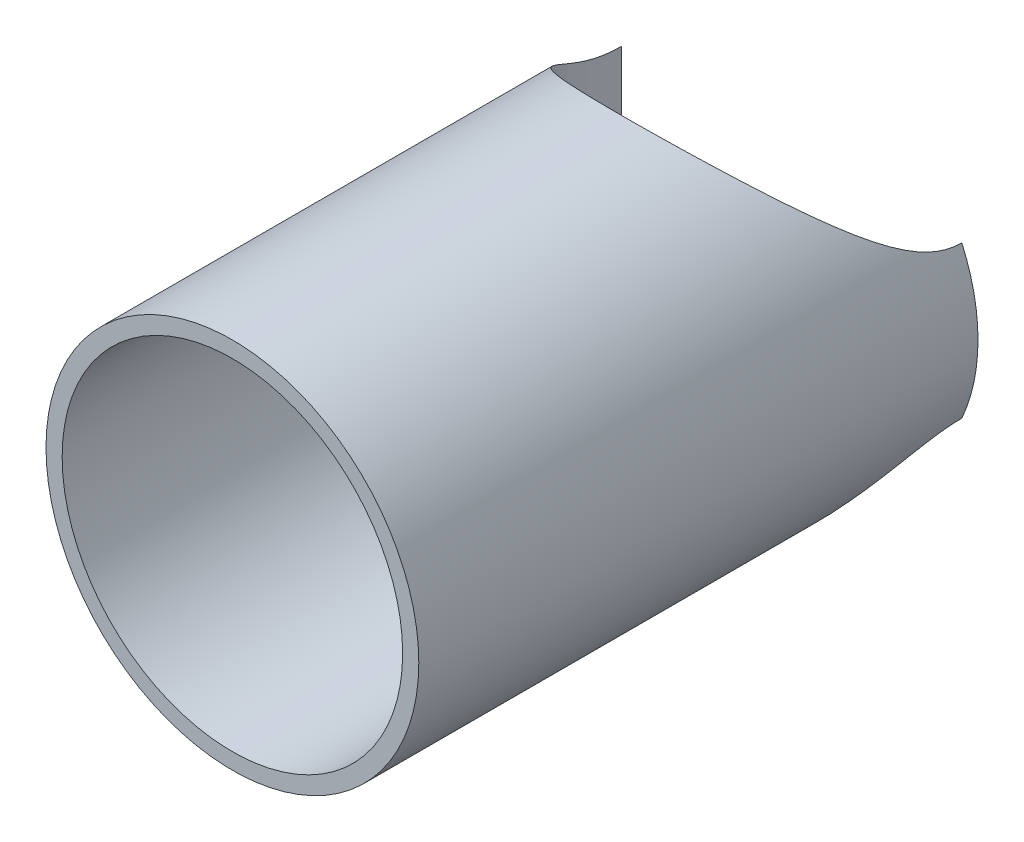
ISO-10303-21;
HEADER;
FILE_DESCRIPTION(('STEP AP214'),'2;1');
FILE_NAME('part.step','',(''),(''),'','','');
FILE_SCHEMA(('AUTOMOTIVE_DESIGN { 1 0 10303 214 1 1 1 1 }'));
ENDSEC;
DATA;
#1=APPLICATION_CONTEXT('core data for automotive mechanical design processes');
#2=APPLICATION_PROTOCOL_DEFINITION('international standard','automotive_design',2000,#1);
#3=PRODUCT_CONTEXT('',#1,'mechanical');
#4=PRODUCT('Part','Part','',(#3));
#5=PRODUCT_RELATED_PRODUCT_CATEGORY('part','',(#4));
#6=PRODUCT_DEFINITION_FORMATION('','',#4);
#7=PRODUCT_DEFINITION_CONTEXT('part definition',#1,'design');
#8=PRODUCT_DEFINITION('design','',#6,#7);
#9=PRODUCT_DEFINITION_SHAPE('','',#8);
#10=(LENGTH_UNIT() NAMED_UNIT(*) SI_UNIT(.MILLI.,.METRE.));
#11=(NAMED_UNIT(*) PLANE_ANGLE_UNIT() SI_UNIT($,.RADIAN.));
#12=(NAMED_UNIT(*) SI_UNIT($,.STERADIAN.) SOLID_ANGLE_UNIT());
#13=UNCERTAINTY_MEASURE_WITH_UNIT(LENGTH_MEASURE(1.E-05),#10,'distance_accuracy_value','');
#14=(GEOMETRIC_REPRESENTATION_CONTEXT(3) GLOBAL_UNCERTAINTY_ASSIGNED_CONTEXT((#13)) GLOBAL_UNIT_ASSIGNED_CONTEXT((#10,
#11,#12)) REPRESENTATION_CONTEXT('',''));
#15=CARTESIAN_POINT('',(0.,0.,0.));
#16=DIRECTION('',(0.,0.,1.));
#17=DIRECTION('',(1.,0.,0.));
#18=AXIS2_PLACEMENT_3D('',#15,#16,#17);
#19=CARTESIAN_POINT('',(0.,0.,0.));
#20=DIRECTION('',(0.,0.,1.));
#21=DIRECTION('',(1.,0.,0.));
#22=AXIS2_PLACEMENT_3D('',#19,#20,#21);
#23=CYLINDRICAL_SURFACE('',#22,17.399);
#24=CARTESIAN_POINT('',(0.,0.,57.15));
#25=DIRECTION('',(0.,0.,1.));
#26=DIRECTION('',(1.,0.,0.));
#27=AXIS2_PLACEMENT_3D('',#24,#25,#26);
#28=CIRCLE('',#27,17.399);
#29=CARTESIAN_POINT('',(17.399,0.,57.15));
#30=VERTEX_POINT('',#29);
#31=EDGE_CURVE('E64',#30,#30,#28,.T.);
#32=ORIENTED_EDGE('',*,*,#31,.T.);
#33=EDGE_LOOP('',(#32));
#34=FACE_BOUND('',#33,.T.);
#35=CARTESIAN_POINT('',(0.,0.,0.));
#36=DIRECTION('',(0.,0.707106781186547,0.707106781186547));
#37=DIRECTION('',(0.,-0.707106781186547,0.707106781186547));
#38=AXIS2_PLACEMENT_3D('',#35,#36,#37);
#39=ELLIPSE('',#38,24.6059017717295,17.399);
#40=CARTESIAN_POINT('',(17.399,0.,0.));
#41=VERTEX_POINT('',#40);
#42=CARTESIAN_POINT('',(-17.399,0.,0.));
#43=VERTEX_POINT('',#42);
#44=EDGE_CURVE('E67',#41,#43,#39,.F.);
#45=ORIENTED_EDGE('',*,*,#44,.T.);
#46=CARTESIAN_POINT('',(-17.399,0.,0.));
#47=CARTESIAN_POINT('',(-17.3990011308637,0.331328994913658,0.331288499369272));
#48=CARTESIAN_POINT('',(-17.3895359806133,0.662777773993524,0.662452537391861));
#49=CARTESIAN_POINT('',(-17.3541828902262,1.28061881246956,1.27984220901783));
#50=CARTESIAN_POINT('',(-17.3306707170862,1.56708522254114,1.56613126731348));
#51=CARTESIAN_POINT('',(-17.2741593932983,2.09467960281504,2.09380128423432));
#52=CARTESIAN_POINT('',(-17.2431973119173,2.33594824844743,2.33526043823023));
#53=CARTESIAN_POINT('',(-17.1776790099059,2.77346193365283,2.77318291899473));
#54=CARTESIAN_POINT('',(-17.1448260231368,2.96984141024758,2.96976916303656));
#55=CARTESIAN_POINT('',(-17.053195396441,3.46498957987095,3.46509972389225));
#56=CARTESIAN_POINT('',(-16.98985851291,3.76343285860517,3.76334049026127));
#57=CARTESIAN_POINT('',(-16.8511806994521,4.34120611378342,4.34086899698307));
#58=CARTESIAN_POINT('',(-16.7767389829828,4.62064871339775,4.62026081720835));
#59=CARTESIAN_POINT('',(-16.618357658026,5.16038592403,5.16002415026488));
#60=CARTESIAN_POINT('',(-16.5352733410015,5.42080962241243,5.42051715790507));
#61=CARTESIAN_POINT('',(-16.3619682824427,5.9225854699662,5.92246621840775));
#62=CARTESIAN_POINT('',(-16.2725596410971,6.16407928160144,6.16406139907093));
#63=CARTESIAN_POINT('',(-16.0648641936773,6.68870400423923,6.68872514664784));
#64=CARTESIAN_POINT('',(-15.9442842191765,6.97140000285117,6.97132558864669));
#65=CARTESIAN_POINT('',(-15.692090264551,7.52138357655295,7.52117234296158));
#66=CARTESIAN_POINT('',(-15.5611400425067,7.7888244237628,7.78856984279287));
#67=CARTESIAN_POINT('',(-15.2898825899193,8.30823658158246,8.30799045094507));
#68=CARTESIAN_POINT('',(-15.1502208515848,8.56037821331848,8.56017986480889));
#69=CARTESIAN_POINT('',(-14.8631475667476,9.04924098266211,9.04916207079481));
#70=CARTESIAN_POINT('',(-14.716363574788,9.28614688008941,9.28613845727461));
#71=CARTESIAN_POINT('',(-14.3951906833458,9.77740171343267,9.77741091638758));
#72=CARTESIAN_POINT('',(-14.2195041976432,10.0313338750929,10.0312781848761));
#73=CARTESIAN_POINT('',(-13.8583245878214,10.524357664459,10.5242054716175));
#74=CARTESIAN_POINT('',(-13.6733966582859,10.7636567269108,10.7634718304358));
#75=CARTESIAN_POINT('',(-13.2950314709039,11.2273598541476,11.2271796122021));
#76=CARTESIAN_POINT('',(-13.1021449124595,11.4519894946947,11.4518441165275));
#77=CARTESIAN_POINT('',(-12.7091177143155,11.8863833716026,11.8863260772742));
#78=CARTESIAN_POINT('',(-12.5095124093792,12.0963898718007,12.0963850678313));
#79=CARTESIAN_POINT('',(-12.0888476825434,12.5170535611354,12.5170585405004));
#80=CARTESIAN_POINT('',(-11.867271036784,12.7274545640097,12.7274132906681));
#81=CARTESIAN_POINT('',(-11.4161369932612,13.1334001596869,13.1332890696922));
#82=CARTESIAN_POINT('',(-11.1870452916996,13.3292035388693,13.3290682211509));
#83=CARTESIAN_POINT('',(-10.7219396261346,13.7059083660326,13.7057759704559));
#84=CARTESIAN_POINT('',(-10.4863707163118,13.8870849012415,13.8869780619076));
#85=CARTESIAN_POINT('',(-10.0093409437893,14.2345561896179,14.2345143840518));
#86=CARTESIAN_POINT('',(-9.76830223262916,14.4011404127409,14.4011376187175));
#87=CARTESIAN_POINT('',(-9.27469282491392,14.7238513521684,14.7238541327518));
#88=CARTESIAN_POINT('',(-9.02218317762893,14.8800245173527,14.8799942085943));
#89=CARTESIAN_POINT('',(-8.51143320550011,15.17780577695,15.1777255632559));
#90=CARTESIAN_POINT('',(-8.25351231100356,15.3196868999698,15.3195894701364));
#91=CARTESIAN_POINT('',(-7.86055793692457,15.522822723787,15.5227259132659));
#92=CARTESIAN_POINT('',(-7.72987393547371,15.5883224924115,15.5882301268393));
#93=CARTESIAN_POINT('',(-7.46744079934224,15.7157097134347,15.7156329083403));
#94=CARTESIAN_POINT('',(-7.33572578439618,15.7776322605029,15.7775664862578));
#95=CARTESIAN_POINT('',(-7.0713408526649,15.89786675948,15.8978253102093));
#96=CARTESIAN_POINT('',(-6.93870294731716,15.9562139212813,15.9561857364243));
#97=CARTESIAN_POINT('',(-6.67257484172981,16.0693059665347,16.0692983003262));
#98=CARTESIAN_POINT('',(-6.5391145696896,16.124086000282,16.1240856593634));
#99=CARTESIAN_POINT('',(-6.27314212663758,16.2293820508048,16.2293823833748));
#100=CARTESIAN_POINT('',(-6.14068677200883,16.2799696359967,16.2799636546496));
#101=CARTESIAN_POINT('',(-5.8748684496391,16.3777589819801,16.3777371159858));
#102=CARTESIAN_POINT('',(-5.74152553126073,16.4249879659121,16.4249565601746));
#103=CARTESIAN_POINT('',(-5.47402115877983,16.5160550971116,16.5160062636609));
#104=CARTESIAN_POINT('',(-5.33987788890363,16.5599199494832,16.5598632139616));
#105=CARTESIAN_POINT('',(-5.0708615482511,16.6442561413558,16.6441886913204));
#106=CARTESIAN_POINT('',(-4.93600480608221,16.6847535344294,16.6846832285512));
#107=CARTESIAN_POINT('',(-4.66564969995905,16.7623545036231,16.762284561608));
#108=CARTESIAN_POINT('',(-4.53016583341798,16.7994833464645,16.7994165741733));
#109=CARTESIAN_POINT('',(-4.25864402464156,16.8703492415508,16.8702936771996));
#110=CARTESIAN_POINT('',(-4.1226187875179,16.9041106384636,16.9040630739031));
#111=CARTESIAN_POINT('',(-3.85010126264908,16.9682459387044,16.9682159832133));
#112=CARTESIAN_POINT('',(-3.7136199403314,16.9986431310521,16.9986227724491));
#113=CARTESIAN_POINT('',(-3.44027598403682,17.0560566629996,17.0560512035975));
#114=CARTESIAN_POINT('',(-3.30342264906392,17.0830951044979,17.0830949768953));
#115=CARTESIAN_POINT('',(-3.03546364409865,17.1326815825355,17.132681703699));
#116=CARTESIAN_POINT('',(-2.90441642762355,17.1553873643714,17.1553829144864));
#117=CARTESIAN_POINT('',(-2.64192370290757,17.1977626436417,17.1977466393632));
#118=CARTESIAN_POINT('',(-2.51048219796085,17.2174445285761,17.2174215511955));
#119=CARTESIAN_POINT('',(-2.24727207444598,17.2537692378582,17.2537335254227));
#120=CARTESIAN_POINT('',(-2.11550651579715,17.2704231484942,17.2703816696755));
#121=CARTESIAN_POINT('',(-1.85171901959868,17.3006908882117,17.3006415630633));
#122=CARTESIAN_POINT('',(-1.71969931056298,17.3143144308917,17.3142630138654));
#123=CARTESIAN_POINT('',(-1.45547409463277,17.3385220761164,17.3384708920411));
#124=CARTESIAN_POINT('',(-1.323270104293,17.3491144575098,17.3490655860987));
#125=CARTESIAN_POINT('',(-1.05874661674972,17.3672620877226,17.36722140925));
#126=CARTESIAN_POINT('',(-0.926428051590948,17.3748241285407,17.3747893222893));
#127=CARTESIAN_POINT('',(-0.661745401360201,17.3869150272733,17.3868930938386));
#128=CARTESIAN_POINT('',(-0.529381797623768,17.3914491490759,17.3914342142522));
#129=CARTESIAN_POINT('',(-0.264678682179303,17.3974897824417,17.3974858865217));
#130=CARTESIAN_POINT('',(-0.13233933998178,17.3989999999915,17.3990001479815));
#131=CARTESIAN_POINT('',(0.132343102844987,17.3990000000085,17.3989998520142));
#132=CARTESIAN_POINT('',(0.264686203474104,17.3974896965932,17.3974852084662));
#133=CARTESIAN_POINT('',(0.529395756251864,17.3914487446318,17.3914329206721));
#134=CARTESIAN_POINT('',(0.661762040001853,17.3869144144388,17.3868915915467));
#135=CARTESIAN_POINT('',(0.92644896772938,17.3748230255675,17.3747874520819));
#136=CARTESIAN_POINT('',(1.0587691326032,17.3672607273787,17.3672194044208));
#137=CARTESIAN_POINT('',(1.32329473756529,17.3491125827395,17.3490633877189));
#138=CARTESIAN_POINT('',(1.4554992489517,17.3385199686424,17.3384686592246));
#139=CARTESIAN_POINT('',(1.71972442920772,17.3143119319016,17.3142607827641));
#140=CARTESIAN_POINT('',(1.85174358595603,17.3006882546736,17.300639392332));
#141=CARTESIAN_POINT('',(2.11552890590344,17.2704203934741,17.270379685527));
#142=CARTESIAN_POINT('',(2.24729284607558,17.2537665200233,17.2537316913085));
#143=CARTESIAN_POINT('',(2.51049867631982,17.2174421050912,17.2174201090593));
#144=CARTESIAN_POINT('',(2.64193751299076,17.1977605012373,17.1977454625961));
#145=CARTESIAN_POINT('',(2.90442384157753,17.1553860801165,17.1553822628499));
#146=CARTESIAN_POINT('',(3.03546733761075,17.1326808990283,17.1326813342488));
#147=CARTESIAN_POINT('',(3.30342657291425,17.0830943783941,17.0830939200179));
#148=CARTESIAN_POINT('',(3.44028379405071,17.0560551202761,17.0560490037316));
#149=CARTESIAN_POINT('',(3.71363437804045,16.9986400001387,16.9986186527062));
#150=CARTESIAN_POINT('',(3.85011845296442,16.9682420615591,16.9682111142236));
#151=CARTESIAN_POINT('',(4.12264033144995,16.904105398461,16.9040569697761));
#152=CARTESIAN_POINT('',(4.25866718163659,16.870343410098,16.8702871133423));
#153=CARTESIAN_POINT('',(4.53019108564152,16.7994765416222,16.7994093825609));
#154=CARTESIAN_POINT('',(4.66567544748057,16.76234734177,16.7622772275004));
#155=CARTESIAN_POINT('',(4.9360304323311,16.6847459483422,16.6846758961775));
#156=CARTESIAN_POINT('',(5.0708865720189,16.6442485126905,16.6441815277317));
#157=CARTESIAN_POINT('',(5.33990061783175,16.55991260583,16.5598566711235));
#158=CARTESIAN_POINT('',(5.47404221030653,16.5160481053818,16.5160001963081));
#159=CARTESIAN_POINT('',(5.74154217437029,16.4249821235549,16.4249517522341));
#160=CARTESIAN_POINT('',(5.87488237757024,16.3777539610281,16.377733114662));
#161=CARTESIAN_POINT('',(6.14069421589947,16.2799667936959,16.2799614823963));
#162=CARTESIAN_POINT('',(6.27314581793012,16.2293805894571,16.2293812542933));
#163=CARTESIAN_POINT('',(6.53911843369672,16.1240844705558,16.1240837889914));
#164=CARTESIAN_POINT('',(6.6725825007365,16.0693028234905,16.0692944809927));
#165=CARTESIAN_POINT('',(6.93871704145251,15.9562078188688,15.956178611685));
#166=CARTESIAN_POINT('',(7.07135760783225,15.8978593336773,15.8978168557831));
#167=CARTESIAN_POINT('',(7.33574670377706,15.7776225505781,15.7775558713312));
#168=CARTESIAN_POINT('',(7.46746324313444,15.7156990653493,15.7156214868573));
#169=CARTESIAN_POINT('',(7.72989830986156,15.5883104113434,15.5882176122188));
#170=CARTESIAN_POINT('',(7.86058273950878,15.5228101701612,15.5227131352272));
#171=CARTESIAN_POINT('',(8.25353521535424,15.3196745134129,15.3195775255319));
#172=CARTESIAN_POINT('',(8.51145389332373,15.177794126177,15.1777148432391));
#173=CARTESIAN_POINT('',(9.02219526517278,14.8800170481196,14.8799876943916));
#174=CARTESIAN_POINT('',(9.27469871505861,14.7238475016823,14.7238507467716));
#175=CARTESIAN_POINT('',(9.76830834571355,14.4011364157789,14.4011331548459));
#176=CARTESIAN_POINT('',(10.0093528614838,14.2345479589407,14.2345052423058));
#177=CARTESIAN_POINT('',(10.4863899241457,13.8870704451552,13.8869626730327));
#178=CARTESIAN_POINT('',(10.7219605410667,13.7058920566566,13.7057591792237));
#179=CARTESIAN_POINT('',(11.1870656131564,13.3291864289314,13.3290515004162));
#180=CARTESIAN_POINT('',(11.4161552377849,13.1333842417648,13.1332739587925));
#181=CARTESIAN_POINT('',(11.8672815432061,12.7274445947568,12.7274041499341));
#182=CARTESIAN_POINT('',(12.088852755031,12.5170484889207,12.517053873492));
#183=CARTESIAN_POINT('',(12.5095175578729,12.0963847230684,12.0963795279133));
#184=CARTESIAN_POINT('',(12.7091276713605,11.8863729021756,11.8863148376935));
#185=CARTESIAN_POINT('',(13.1021607290177,11.4519714571547,11.4518252711373));
#186=CARTESIAN_POINT('',(13.2950485751887,11.2273396628897,11.2271589823143));
#187=CARTESIAN_POINT('',(13.6734130173025,10.7636358783721,10.763451251504));
#188=CARTESIAN_POINT('',(13.858339153512,10.524338411798,10.5241868247927));
#189=CARTESIAN_POINT('',(14.2195124215554,10.031321996054,10.0312669453136));
#190=CARTESIAN_POINT('',(14.3951946051437,9.7773957150844,9.77740523066256));
#191=CARTESIAN_POINT('',(14.7163674472392,9.28614095665167,9.28613224729147));
#192=CARTESIAN_POINT('',(14.8631549792588,9.04922902525791,9.04914954618527));
#193=CARTESIAN_POINT('',(15.1502323847489,8.56035787657117,8.56015891678717));
#194=CARTESIAN_POINT('',(15.2898949291603,8.30821395404564,8.3079674730765));
#195=CARTESIAN_POINT('',(15.5611515555253,7.78880133314123,7.78854689744975));
#196=CARTESIAN_POINT('',(15.6921003797321,7.52136237689545,7.52115152000875));
#197=CARTESIAN_POINT('',(15.944289741381,6.97138706353182,6.97131306349413));
#198=CARTESIAN_POINT('',(16.0648667682493,6.68869750139016,6.68871884448677));
#199=CARTESIAN_POINT('',(16.2725620824778,6.16407311454511,6.16405506139386));
#200=CARTESIAN_POINT('',(16.3619728725739,5.92257307722494,5.92245348547243));
#201=CARTESIAN_POINT('',(16.535280221155,5.42078874277266,5.42049589512133));
#202=CARTESIAN_POINT('',(16.618364872423,5.16036280687721,5.16000079710574));
#203=CARTESIAN_POINT('',(16.7767453827511,4.62062534005807,4.62023748154183));
#204=CARTESIAN_POINT('',(16.8511861632785,4.34118475559803,4.34084779902526));
#205=CARTESIAN_POINT('',(16.9898612578486,3.76341993156685,3.7633277559053));
#206=CARTESIAN_POINT('',(17.053196594646,3.464983105639,3.46509333680204));
#207=CARTESIAN_POINT('',(17.1448268330524,2.96983703330779,2.96976472575839));
#208=CARTESIAN_POINT('',(17.1776804769336,2.77345316738225,2.7731740281345));
#209=CARTESIAN_POINT('',(17.2431993186325,2.33593358655074,2.33524560548374));
#210=CARTESIAN_POINT('',(17.2741613748475,2.09466343246891,2.09378498081143));
#211=CARTESIAN_POINT('',(17.3306721606797,1.567068988297,1.56611497024853));
#212=CARTESIAN_POINT('',(17.3541839563502,1.28060403473809,1.27982739369487));
#213=CARTESIAN_POINT('',(17.3895362343148,0.66276888754068,0.662443645442081));
#214=CARTESIAN_POINT('',(17.3990011304629,0.331324551349306,0.331284053321532));
#215=CARTESIAN_POINT('',(17.399,0.,0.));
#216=B_SPLINE_CURVE_WITH_KNOTS('',3,(#46,#47,#48,#49,#50,#51,#52,#53,#54,#55,#56,#57,#58,#59,
#60,#61,#62,#63,#64,#65,#66,#67,#68,#69,#70,#71,#72,#73,#74,#75,#76,#77,#78,#79,#80,#81,#82,#83,
#84,#85,#86,#87,#88,#89,#90,#91,#92,#93,#94,#95,#96,#97,#98,#99,#100,#101,#102,#103,#104,#105,
#106,#107,#108,#109,#110,#111,#112,#113,#114,#115,#116,#117,#118,#119,#120,#121,#122,#123,#124,
#125,#126,#127,#128,#129,#130,#131,#132,#133,#134,#135,#136,#137,#138,#139,#140,#141,#142,#143,
#144,#145,#146,#147,#148,#149,#150,#151,#152,#153,#154,#155,#156,#157,#158,#159,#160,#161,#162,
#163,#164,#165,#166,#167,#168,#169,#170,#171,#172,#173,#174,#175,#176,#177,#178,#179,#180,#181,
#182,#183,#184,#185,#186,#187,#188,#189,#190,#191,#192,#193,#194,#195,#196,#197,#198,#199,#200,
#201,#202,#203,#204,#205,#206,#207,#208,#209,#210,#211,#212,#213,#214,#215),.UNSPECIFIED.,.F.,
.F.,(4,2,2,2,2,2,2,2,2,2,2,2,2,2,2,2,2,2,2,2,2,2,2,2,2,2,2,2,2,2,2,2,2,2,2,2,2,2,2,2,2,2,2,2,2,
2,2,2,2,2,2,2,2,2,2,2,2,2,2,2,2,2,2,2,2,2,2,2,2,2,2,2,2,2,2,2,2,2,2,2,2,2,2,2,4),(0.,
1.40551630396895,2.62231117885233,3.65037899448081,4.48971758438184,5.76932583809445,
6.9753849332022,8.10794438794428,9.16706431128378,10.4192554462773,11.6195891287589,
12.7682494574323,13.8654466039762,15.0642686263511,16.2207668838282,17.3353827550133,
18.4086093128293,19.521019988392,20.5986721998633,21.6423941807822,22.6530975875911,
23.6589392392227,24.6386430781611,25.1191397415278,25.5935874776259,26.0621612660575,
26.5250427479471,26.9765889886385,27.423915460162,27.867213682969,28.3066804441005,
28.7425177205185,29.1749325751135,29.6041370240872,30.0303478746664,30.4350509025217,
30.8380491089705,31.239540728672,31.6397262351866,32.0388080704063,32.4369903595961,
32.8344786138765,33.23147942219,33.6284915186038,34.0259878478789,34.42417498677,
34.8232584392862,35.2234423286034,35.6249290994545,36.0279192330441,36.4326109763195,
36.8588341719642,37.2880474518629,37.720467610057,38.1563066551372,38.5957716476569,
39.0390645671939,39.486382208024,39.9379161021075,40.4008112215822,40.8693947623903,
41.3438483542563,41.8243469702461,42.8040430011724,43.8098612581141,44.8205903103499,
45.8643208478344,46.9419645023942,48.0543495253715,49.1276035107911,50.2422285290847,
51.3987176391151,52.5975122283296,53.6947376105801,54.8434073531731,56.043731621553,
57.2958945179331,58.3550419584849,59.487610586171,60.6936605083512,61.9732412444898,
62.8125986887249,63.8406727889923,65.0574613794757,66.4629588311663),.UNSPECIFIED.);
#217=EDGE_CURVE('E56',#43,#41,#216,.T.);
#218=ORIENTED_EDGE('',*,*,#217,.T.);
#219=EDGE_LOOP('',(#45,#218));
#220=FACE_BOUND('',#219,.T.);
#221=ADVANCED_FACE('F17',(#34,#220),#23,.F.);
#222=CARTESIAN_POINT('',(0.,0.,57.15));
#223=DIRECTION('',(0.,0.,-1.));
#224=DIRECTION('',(-1.,0.,0.));
#225=AXIS2_PLACEMENT_3D('',#222,#223,#224);
#226=PLANE('',#225);
#227=ORIENTED_EDGE('',*,*,#31,.F.);
#228=EDGE_LOOP('',(#227));
#229=FACE_BOUND('',#228,.T.);
#230=CARTESIAN_POINT('',(0.,0.,57.15));
#231=DIRECTION('',(0.,0.,1.));
#232=DIRECTION('',(1.,0.,0.));
#233=AXIS2_PLACEMENT_3D('',#230,#231,#232);
#234=CIRCLE('',#233,19.05);
#235=CARTESIAN_POINT('',(19.05,0.,57.15));
#236=VERTEX_POINT('',#235);
#237=EDGE_CURVE('E87',#236,#236,#234,.F.);
#238=ORIENTED_EDGE('',*,*,#237,.F.);
#239=EDGE_LOOP('',(#238));
#240=FACE_BOUND('',#239,.T.);
#241=ADVANCED_FACE('F122',(#229,#240),#226,.F.);
#242=CARTESIAN_POINT('',(0.,0.,0.));
#243=DIRECTION('',(0.,1.,0.));
#244=DIRECTION('',(0.,0.,1.));
#245=AXIS2_PLACEMENT_3D('',#242,#243,#244);
#246=CYLINDRICAL_SURFACE('',#245,17.399);
#247=ORIENTED_EDGE('',*,*,#217,.F.);
#248=DIRECTION('',(0.,1.,0.));
#249=VECTOR('',#248,1.);
#250=CARTESIAN_POINT('',(-17.399,0.,0.));
#251=LINE('',#250,#249);
#252=CARTESIAN_POINT('',(-17.399,7.75740285147033,0.));
#253=VERTEX_POINT('',#252);
#254=EDGE_CURVE('E61',#253,#43,#251,.F.);
#255=ORIENTED_EDGE('',*,*,#254,.F.);
#256=CARTESIAN_POINT('',(17.399,7.75740285147032,0.));
#257=CARTESIAN_POINT('',(17.3990027926557,7.75738928067626,0.126619411653411));
#258=CARTESIAN_POINT('',(17.3976172953479,7.76050481767002,0.25321342214225));
#259=CARTESIAN_POINT('',(17.3920993093259,7.7728663106787,0.506011561056936));
#260=CARTESIAN_POINT('',(17.3879674951789,7.78211076127069,0.632215777580589));
#261=CARTESIAN_POINT('',(17.3715310393773,7.81876986710136,1.00902330778525));
#262=CARTESIAN_POINT('',(17.3551849725285,7.85511193712096,1.25863541656879));
#263=CARTESIAN_POINT('',(17.3126787054344,7.94834436267528,1.74803233786395));
#264=CARTESIAN_POINT('',(17.2867118539878,8.00482912325347,1.98791378893045));
#265=CARTESIAN_POINT('',(17.2256220476168,8.13545614886296,2.46176178605719));
#266=CARTESIAN_POINT('',(17.1904915826852,8.20961289257842,2.69572330712606));
#267=CARTESIAN_POINT('',(17.0914704002142,8.41444164911149,3.27608545997221));
#268=CARTESIAN_POINT('',(17.0220928683165,8.55453145327276,3.6182148201961));
#269=CARTESIAN_POINT('',(16.8659507450822,8.85840913920196,4.2875618159471));
#270=CARTESIAN_POINT('',(16.7791763237468,9.02221040436538,4.6147708919803));
#271=CARTESIAN_POINT('',(16.5885907607409,9.36806215757178,5.25908025866418));
#272=CARTESIAN_POINT('',(16.4846028375362,9.55029344833314,5.57602990071133));
#273=CARTESIAN_POINT('',(16.2611162606568,9.92604811707565,6.19761374754541));
#274=CARTESIAN_POINT('',(16.1416117153161,10.1195757688457,6.50224321644266));
#275=CARTESIAN_POINT('',(15.9012328343761,10.4927199440383,7.0682446326165));
#276=CARTESIAN_POINT('',(15.7818795075659,10.6716028930283,7.33075234639334));
#277=CARTESIAN_POINT('',(15.531375280231,11.0330066315397,7.84755054304734));
#278=CARTESIAN_POINT('',(15.4002228366692,11.2155278944272,8.10183994524194));
#279=CARTESIAN_POINT('',(15.1261173325553,11.5825543909568,8.60275103720113));
#280=CARTESIAN_POINT('',(14.9831580377589,11.7670606274058,8.84936858024162));
#281=CARTESIAN_POINT('',(14.6854749405307,12.1365419716062,9.33504840785215));
#282=CARTESIAN_POINT('',(14.5307500246226,12.3215171221294,9.57410997430043));
#283=CARTESIAN_POINT('',(14.0499414824725,12.873976753931,10.2784757466186));
#284=CARTESIAN_POINT('',(13.706221982577,13.2403569500405,10.7327911450247));
#285=CARTESIAN_POINT('',(12.9709988366539,13.9614056628348,11.6105902831832));
#286=CARTESIAN_POINT('',(12.5795204493307,14.3160802453506,12.0340901330639));
#287=CARTESIAN_POINT('',(11.8513027830295,14.9202493412787,12.7460780346227));
#288=CARTESIAN_POINT('',(11.5252152004648,15.17393857843,13.0419213680792));
#289=CARTESIAN_POINT('',(10.8451357651757,15.6672254345686,13.6126880208168));
#290=CARTESIAN_POINT('',(10.4911442114866,15.9068232045201,13.8876115642246));
#291=CARTESIAN_POINT('',(9.75564643242529,16.3682053590736,14.4137713143204));
#292=CARTESIAN_POINT('',(9.37416774185506,16.5900071123435,14.6650306596365));
#293=CARTESIAN_POINT('',(8.58390774378863,17.0123369264844,15.1411487148883));
#294=CARTESIAN_POINT('',(8.17513251731962,17.2128696999897,15.3660132743823));
#295=CARTESIAN_POINT('',(7.41609675759785,17.5510787980119,15.7438449488538));
#296=CARTESIAN_POINT('',(7.07052907343836,17.6932976749746,15.9021892450144));
#297=CARTESIAN_POINT('',(6.36382451687043,17.9595864108884,16.1979501260028));
#298=CARTESIAN_POINT('',(6.00269106933712,18.0836602360993,16.3353712846128));
#299=CARTESIAN_POINT('',(5.26647789377182,18.3116118596446,16.5873660705376));
#300=CARTESIAN_POINT('',(4.89140366751785,18.4154975265765,16.7019485999545));
#301=CARTESIAN_POINT('',(4.12923028647434,18.6012306252741,16.9065171053999));
#302=CARTESIAN_POINT('',(3.74213100127713,18.6830778179467,16.9965028145804));
#303=CARTESIAN_POINT('',(2.95593537190506,18.8235337773239,17.1507769807365));
#304=CARTESIAN_POINT('',(2.55677683000922,18.8819860313285,17.2148923872178));
#305=CARTESIAN_POINT('',(1.75207798329656,18.9735785556383,17.3153056168189));
#306=CARTESIAN_POINT('',(1.34653766138734,19.0067187581382,17.3516033654214));
#307=CARTESIAN_POINT('',(0.532740871466215,19.0469054092445,17.3956140232931));
#308=CARTESIAN_POINT('',(0.124485289769621,19.0539599906146,17.4033358417348));
#309=CARTESIAN_POINT('',(-0.691145635542919,19.0418258138202,17.3900500247943));
#310=CARTESIAN_POINT('',(-1.09852104488593,19.02263908821,17.3690446145166));
#311=CARTESIAN_POINT('',(-1.8665074066449,18.9618364386318,17.3024305274246));
#312=CARTESIAN_POINT('',(-2.22756908470296,18.9227652631555,17.2596128163397));
#313=CARTESIAN_POINT('',(-2.94361664813323,18.8246695916722,17.1520079260685));
#314=CARTESIAN_POINT('',(-3.29860304440391,18.7656467822389,17.0872226038712));
#315=CARTESIAN_POINT('',(-4.0003834177903,18.6286682489913,16.9366748894927));
#316=CARTESIAN_POINT('',(-4.34717668373009,18.5507108882069,16.8509106835957));
#317=CARTESIAN_POINT('',(-5.03073264287061,18.3771216594109,16.65961931318));
#318=CARTESIAN_POINT('',(-5.36749474073485,18.2814887447958,16.5540909783843));
#319=CARTESIAN_POINT('',(-6.0450883689476,18.0690712727941,16.319211609248));
#320=CARTESIAN_POINT('',(-6.38536566225004,17.9515031398445,16.1889732182396));
#321=CARTESIAN_POINT('',(-7.05200979717746,17.7002421296737,15.9099012910429));
#322=CARTESIAN_POINT('',(-7.37837661185776,17.5665492212207,15.7610677188377));
#323=CARTESIAN_POINT('',(-8.01637955747606,17.2847274052077,15.4463398391999));
#324=CARTESIAN_POINT('',(-8.328012631591,17.1365955213283,15.2804420139058));
#325=CARTESIAN_POINT('',(-8.935938653738,16.8275912941987,14.9330779736276));
#326=CARTESIAN_POINT('',(-9.23222831724048,16.6667162415391,14.751608447154));
#327=CARTESIAN_POINT('',(-9.9610807011477,16.24616265681,14.2751141336036));
#328=CARTESIAN_POINT('',(-10.3832304302347,15.9790705087056,13.9706188807904));
#329=CARTESIAN_POINT('',(-11.1906483352997,15.4243967388524,13.3326512383542));
#330=CARTESIAN_POINT('',(-11.5758996118658,15.1368058328948,12.9991657033674));
#331=CARTESIAN_POINT('',(-12.3107246973626,14.5454983316236,12.3055766392129));
#332=CARTESIAN_POINT('',(-12.6601983724747,14.2417399093146,11.9454030182208));
#333=CARTESIAN_POINT('',(-13.3228256699069,13.6238744147983,11.2015895641249));
#334=CARTESIAN_POINT('',(-13.6359864105728,13.3097693863682,10.8179543527437));
#335=CARTESIAN_POINT('',(-14.2338486111263,12.6687294700676,10.0188698517803));
#336=CARTESIAN_POINT('',(-14.517686463156,12.3416676006416,9.60287793519721));
#337=CARTESIAN_POINT('',(-15.0487827113267,11.688186754623,8.74718214020965));
#338=CARTESIAN_POINT('',(-15.2960234328361,11.3617681633013,8.30746694358541));
#339=CARTESIAN_POINT('',(-15.6391176739874,10.8793160856903,7.62936065904868));
#340=CARTESIAN_POINT('',(-15.7488029782036,10.719778727444,7.40036468575159));
#341=CARTESIAN_POINT('',(-15.9589029321097,10.4044108647402,6.93568044188579));
#342=CARTESIAN_POINT('',(-16.0593187405627,10.2485798987662,6.69999301263361));
#343=CARTESIAN_POINT('',(-16.25064002581,9.94242216980458,6.22159236078593));
#344=CARTESIAN_POINT('',(-16.3415534376162,9.79209088359618,5.9788852198135));
#345=CARTESIAN_POINT('',(-16.5136633013956,9.49896230357114,5.48564865833395));
#346=CARTESIAN_POINT('',(-16.5948621460068,9.35616315949889,5.23512118317326));
#347=CARTESIAN_POINT('',(-16.7399044598348,9.0938654480011,4.74960595279279));
#348=CARTESIAN_POINT('',(-16.8046633839798,8.97344114073015,4.51539494834857));
#349=CARTESIAN_POINT('',(-16.9253972886873,8.74358476749362,4.03935876063696));
#350=CARTESIAN_POINT('',(-16.981371807116,8.63415327995198,3.79753317758154));
#351=CARTESIAN_POINT('',(-17.0835577011958,8.43015385639926,3.30749209621929));
#352=CARTESIAN_POINT('',(-17.1298288043977,8.33549596631582,3.05932691299979));
#353=CARTESIAN_POINT('',(-17.2122316312634,8.16398538994439,2.5552691644349));
#354=CARTESIAN_POINT('',(-17.2483680118588,8.08712452871587,2.29938020825192));
#355=CARTESIAN_POINT('',(-17.2984619179858,7.97921413520514,1.87510757973661));
#356=CARTESIAN_POINT('',(-17.3157056836072,7.94167042397934,1.70875077851932));
#357=CARTESIAN_POINT('',(-17.3454986249528,7.87638621901043,1.37373521286451));
#358=CARTESIAN_POINT('',(-17.35804919276,7.84864281846194,1.20507714643116));
#359=CARTESIAN_POINT('',(-17.3783689967595,7.80355358549084,0.864236195915917));
#360=CARTESIAN_POINT('',(-17.386085725966,7.78632198711612,0.692034904492624));
#361=CARTESIAN_POINT('',(-17.3964114605965,7.76320820627028,0.346566926126348));
#362=CARTESIAN_POINT('',(-17.3990157927525,7.75733640792047,0.173299409508219));
#363=CARTESIAN_POINT('',(-17.399,7.75740285147036,0.));
#364=B_SPLINE_CURVE_WITH_KNOTS('',3,(#256,#257,#258,#259,#260,#261,#262,#263,#264,#265,#266,
#267,#268,#269,#270,#271,#272,#273,#274,#275,#276,#277,#278,#279,#280,#281,#282,#283,#284,#285,
#286,#287,#288,#289,#290,#291,#292,#293,#294,#295,#296,#297,#298,#299,#300,#301,#302,#303,#304,
#305,#306,#307,#308,#309,#310,#311,#312,#313,#314,#315,#316,#317,#318,#319,#320,#321,#322,#323,
#324,#325,#326,#327,#328,#329,#330,#331,#332,#333,#334,#335,#336,#337,#338,#339,#340,#341,#342,
#343,#344,#345,#346,#347,#348,#349,#350,#351,#352,#353,#354,#355,#356,#357,#358,#359,#360,#361,
#362,#363),.UNSPECIFIED.,.F.,.F.,(4,2,2,2,2,2,2,2,2,2,2,2,2,2,2,2,2,2,2,2,2,2,2,2,2,2,2,2,2,2,2,
2,2,2,2,2,2,2,2,2,2,2,2,2,2,2,2,2,2,2,2,2,2,4),(0.,0.379764092853832,0.759434940165907,
1.51634726991587,2.25880724087371,3.00187761458815,4.12835037763911,5.25546144985719,
6.39496160348711,7.53489569789875,8.55259337985784,9.57042434587642,10.5887962249633,
11.6072646010801,13.6367495933949,15.6651658480776,17.1883664070907,18.71155064481,
20.2332297195439,21.754570923617,22.9709961355442,24.187155054878,25.4028390055058,
26.6185361444175,27.8422355786928,29.0659382909752,30.2892594549617,31.5124858703965,
32.6082843336791,33.7039901888642,34.7997908060849,35.8956563285599,37.043090764153,
38.1905274222329,39.3382011047018,40.4861194600479,42.2386035757021,43.991886525206,
45.749949583538,47.5076674278728,49.3075787665061,51.1083565581975,52.0077767250255,
52.9070843042517,53.8056348105302,54.7039635517725,55.5171752742101,56.3304297641097,
57.1385211097759,57.9462405247014,58.4601584642904,58.9739238458356,59.4931773421598,
60.0129052701035),.UNSPECIFIED.);
#365=CARTESIAN_POINT('',(17.399,7.75740285147032,0.));
#366=VERTEX_POINT('',#365);
#367=EDGE_CURVE('E50',#366,#253,#364,.T.);
#368=ORIENTED_EDGE('',*,*,#367,.F.);
#369=DIRECTION('',(0.,1.,0.));
#370=VECTOR('',#369,1.);
#371=CARTESIAN_POINT('',(17.399,0.,0.));
#372=LINE('',#371,#370);
#373=EDGE_CURVE('E63',#41,#366,#372,.T.);
#374=ORIENTED_EDGE('',*,*,#373,.F.);
#375=EDGE_LOOP('',(#247,#255,#368,#374));
#376=FACE_BOUND('',#375,.T.);
#377=ADVANCED_FACE('F59',(#376),#246,.F.);
#378=CARTESIAN_POINT('',(0.,0.,0.));
#379=DIRECTION('',(0.,0.,-1.));
#380=DIRECTION('',(-1.,0.,0.));
#381=AXIS2_PLACEMENT_3D('',#378,#379,#380);
#382=PLANE('',#381);
#383=DIRECTION('',(0.,1.,0.));
#384=VECTOR('',#383,1.);
#385=CARTESIAN_POINT('',(-17.399,0.,0.));
#386=LINE('',#385,#384);
#387=CARTESIAN_POINT('',(-17.399,-7.75740285147033,0.));
#388=VERTEX_POINT('',#387);
#389=EDGE_CURVE('E69',#43,#388,#386,.F.);
#390=ORIENTED_EDGE('',*,*,#389,.T.);
#391=CARTESIAN_POINT('',(0.,0.,0.));
#392=DIRECTION('',(0.,0.,1.));
#393=DIRECTION('',(1.,0.,0.));
#394=AXIS2_PLACEMENT_3D('',#391,#392,#393);
#395=CIRCLE('',#394,19.05);
#396=EDGE_CURVE('E73',#253,#388,#395,.T.);
#397=ORIENTED_EDGE('',*,*,#396,.F.);
#398=ORIENTED_EDGE('',*,*,#254,.T.);
#399=EDGE_LOOP('',(#390,#397,#398));
#400=FACE_BOUND('',#399,.T.);
#401=ADVANCED_FACE('F71',(#400),#382,.T.);
#402=CARTESIAN_POINT('',(0.,0.,0.));
#403=DIRECTION('',(0.,1.,0.));
#404=DIRECTION('',(0.,0.,1.));
#405=AXIS2_PLACEMENT_3D('',#402,#403,#404);
#406=CYLINDRICAL_SURFACE('',#405,17.399);
#407=ORIENTED_EDGE('',*,*,#389,.F.);
#408=ORIENTED_EDGE('',*,*,#44,.F.);
#409=DIRECTION('',(0.,1.,0.));
#410=VECTOR('',#409,1.);
#411=CARTESIAN_POINT('',(17.399,0.,0.));
#412=LINE('',#411,#410);
#413=CARTESIAN_POINT('',(17.399,-7.75740285147033,0.));
#414=VERTEX_POINT('',#413);
#415=EDGE_CURVE('E36',#414,#41,#412,.T.);
#416=ORIENTED_EDGE('',*,*,#415,.F.);
#417=CARTESIAN_POINT('',(-17.399,-7.75740285147033,0.));
#418=CARTESIAN_POINT('',(-17.3990027926557,-7.75738928067626,0.12661941165341));
#419=CARTESIAN_POINT('',(-17.3976172953479,-7.76050481767003,0.253213422142249));
#420=CARTESIAN_POINT('',(-17.3920993093259,-7.77286631067871,0.506011561056935));
#421=CARTESIAN_POINT('',(-17.3879674951789,-7.78211076127069,0.632215777580588));
#422=CARTESIAN_POINT('',(-17.3715310393773,-7.81876986710136,1.00902330778525));
#423=CARTESIAN_POINT('',(-17.3551849725285,-7.85511193712095,1.25863541656879));
#424=CARTESIAN_POINT('',(-17.3126787054344,-7.94834436267528,1.74803233786395));
#425=CARTESIAN_POINT('',(-17.2867118539878,-8.00482912325347,1.98791378893045));
#426=CARTESIAN_POINT('',(-17.2256220476168,-8.13545614886296,2.46176178605719));
#427=CARTESIAN_POINT('',(-17.1904915826852,-8.20961289257843,2.69572330712606));
#428=CARTESIAN_POINT('',(-17.0914704002142,-8.4144416491115,3.27608545997221));
#429=CARTESIAN_POINT('',(-17.0220928683165,-8.55453145327277,3.6182148201961));
#430=CARTESIAN_POINT('',(-16.8659507450822,-8.85840913920196,4.2875618159471));
#431=CARTESIAN_POINT('',(-16.7791763237468,-9.02221040436538,4.6147708919803));
#432=CARTESIAN_POINT('',(-16.5885907607409,-9.36806215757178,5.25908025866417));
#433=CARTESIAN_POINT('',(-16.4846028375362,-9.55029344833314,5.57602990071133));
#434=CARTESIAN_POINT('',(-16.2611162606568,-9.92604811707565,6.19761374754541));
#435=CARTESIAN_POINT('',(-16.1416117153161,-10.1195757688457,6.50224321644265));
#436=CARTESIAN_POINT('',(-15.9012328343761,-10.4927199440383,7.06824463261649));
#437=CARTESIAN_POINT('',(-15.7818795075659,-10.6716028930283,7.33075234639333));
#438=CARTESIAN_POINT('',(-15.531375280231,-11.0330066315397,7.84755054304734));
#439=CARTESIAN_POINT('',(-15.4002228366692,-11.2155278944272,8.10183994524194));
#440=CARTESIAN_POINT('',(-15.1261173325553,-11.5825543909568,8.60275103720113));
#441=CARTESIAN_POINT('',(-14.9831580377589,-11.7670606274058,8.84936858024161));
#442=CARTESIAN_POINT('',(-14.6854749405307,-12.1365419716061,9.33504840785214));
#443=CARTESIAN_POINT('',(-14.5307500246226,-12.3215171221294,9.57410997430043));
#444=CARTESIAN_POINT('',(-14.0499414824725,-12.873976753931,10.2784757466186));
#445=CARTESIAN_POINT('',(-13.706221982577,-13.2403569500405,10.7327911450247));
#446=CARTESIAN_POINT('',(-12.9709988366539,-13.9614056628348,11.6105902831832));
#447=CARTESIAN_POINT('',(-12.5795204493307,-14.3160802453506,12.0340901330639));
#448=CARTESIAN_POINT('',(-11.8513027830295,-14.9202493412786,12.7460780346226));
#449=CARTESIAN_POINT('',(-11.5252152004648,-15.17393857843,13.0419213680792));
#450=CARTESIAN_POINT('',(-10.8451357651757,-15.6672254345686,13.6126880208168));
#451=CARTESIAN_POINT('',(-10.4911442114866,-15.9068232045201,13.8876115642246));
#452=CARTESIAN_POINT('',(-9.7556464324253,-16.3682053590736,14.4137713143204));
#453=CARTESIAN_POINT('',(-9.37416774185507,-16.5900071123435,14.6650306596365));
#454=CARTESIAN_POINT('',(-8.58390774378864,-17.0123369264844,15.1411487148883));
#455=CARTESIAN_POINT('',(-8.17513251731962,-17.2128696999896,15.3660132743823));
#456=CARTESIAN_POINT('',(-7.41609675759786,-17.5510787980119,15.7438449488538));
#457=CARTESIAN_POINT('',(-7.07052907343837,-17.6932976749746,15.9021892450143));
#458=CARTESIAN_POINT('',(-6.36382451687044,-17.9595864108884,16.1979501260028));
#459=CARTESIAN_POINT('',(-6.00269106933713,-18.0836602360993,16.3353712846128));
#460=CARTESIAN_POINT('',(-5.26647789377183,-18.3116118596446,16.5873660705375));
#461=CARTESIAN_POINT('',(-4.89140366751786,-18.4154975265765,16.7019485999545));
#462=CARTESIAN_POINT('',(-4.12923028647435,-18.6012306252741,16.9065171053999));
#463=CARTESIAN_POINT('',(-3.74213100127715,-18.6830778179467,16.9965028145804));
#464=CARTESIAN_POINT('',(-2.95593537190507,-18.8235337773239,17.1507769807365));
#465=CARTESIAN_POINT('',(-2.55677683000923,-18.8819860313285,17.2148923872178));
#466=CARTESIAN_POINT('',(-1.75207798329657,-18.9735785556383,17.3153056168189));
#467=CARTESIAN_POINT('',(-1.34653766138736,-19.0067187581382,17.3516033654214));
#468=CARTESIAN_POINT('',(-0.53274087146623,-19.0469054092445,17.3956140232931));
#469=CARTESIAN_POINT('',(-0.124485289769636,-19.0539599906146,17.4033358417348));
#470=CARTESIAN_POINT('',(0.691145635542903,-19.0418258138202,17.3900500247943));
#471=CARTESIAN_POINT('',(1.09852104488592,-19.02263908821,17.3690446145166));
#472=CARTESIAN_POINT('',(1.86650740664488,-18.9618364386318,17.3024305274246));
#473=CARTESIAN_POINT('',(2.22756908470294,-18.9227652631555,17.2596128163397));
#474=CARTESIAN_POINT('',(2.94361664813322,-18.8246695916722,17.1520079260685));
#475=CARTESIAN_POINT('',(3.2986030444039,-18.7656467822389,17.0872226038712));
#476=CARTESIAN_POINT('',(4.00038341779028,-18.6286682489913,16.9366748894927));
#477=CARTESIAN_POINT('',(4.34717668373008,-18.5507108882069,16.8509106835957));
#478=CARTESIAN_POINT('',(5.0307326428706,-18.3771216594109,16.65961931318));
#479=CARTESIAN_POINT('',(5.36749474073483,-18.2814887447958,16.5540909783843));
#480=CARTESIAN_POINT('',(6.04508836894759,-18.0690712727941,16.319211609248));
#481=CARTESIAN_POINT('',(6.38536566225002,-17.9515031398445,16.1889732182397));
#482=CARTESIAN_POINT('',(7.05200979717744,-17.7002421296737,15.9099012910429));
#483=CARTESIAN_POINT('',(7.37837661185775,-17.5665492212207,15.7610677188377));
#484=CARTESIAN_POINT('',(8.01637955747604,-17.2847274052077,15.4463398391999));
#485=CARTESIAN_POINT('',(8.32801263159099,-17.1365955213283,15.2804420139058));
#486=CARTESIAN_POINT('',(8.93593865373799,-16.8275912941988,14.9330779736276));
#487=CARTESIAN_POINT('',(9.23222831724047,-16.6667162415391,14.751608447154));
#488=CARTESIAN_POINT('',(9.96108070114769,-16.24616265681,14.2751141336036));
#489=CARTESIAN_POINT('',(10.3832304302346,-15.9790705087056,13.9706188807904));
#490=CARTESIAN_POINT('',(11.1906483352997,-15.4243967388524,13.3326512383542));
#491=CARTESIAN_POINT('',(11.5758996118658,-15.1368058328948,12.9991657033674));
#492=CARTESIAN_POINT('',(12.3107246973626,-14.5454983316236,12.3055766392129));
#493=CARTESIAN_POINT('',(12.6601983724747,-14.2417399093146,11.9454030182208));
#494=CARTESIAN_POINT('',(13.3228256699068,-13.6238744147983,11.2015895641249));
#495=CARTESIAN_POINT('',(13.6359864105728,-13.3097693863682,10.8179543527437));
#496=CARTESIAN_POINT('',(14.2338486111263,-12.6687294700676,10.0188698517803));
#497=CARTESIAN_POINT('',(14.517686463156,-12.3416676006417,9.60287793519723));
#498=CARTESIAN_POINT('',(15.0487827113267,-11.688186754623,8.74718214020967));
#499=CARTESIAN_POINT('',(15.296023432836,-11.3617681633013,8.30746694358543));
#500=CARTESIAN_POINT('',(15.6391176739874,-10.8793160856903,7.6293606590487));
#501=CARTESIAN_POINT('',(15.7488029782035,-10.719778727444,7.40036468575161));
#502=CARTESIAN_POINT('',(15.9589029321096,-10.4044108647403,6.93568044188581));
#503=CARTESIAN_POINT('',(16.0593187405627,-10.2485798987662,6.69999301263363));
#504=CARTESIAN_POINT('',(16.25064002581,-9.9424221698046,6.22159236078595));
#505=CARTESIAN_POINT('',(16.3415534376162,-9.79209088359619,5.97888521981352));
#506=CARTESIAN_POINT('',(16.5136633013956,-9.49896230357115,5.48564865833397));
#507=CARTESIAN_POINT('',(16.5948621460068,-9.35616315949891,5.23512118317328));
#508=CARTESIAN_POINT('',(16.7399044598348,-9.09386544800111,4.74960595279281));
#509=CARTESIAN_POINT('',(16.8046633839798,-8.97344114073016,4.51539494834859));
#510=CARTESIAN_POINT('',(16.9253972886873,-8.74358476749363,4.03935876063698));
#511=CARTESIAN_POINT('',(16.981371807116,-8.63415327995198,3.79753317758156));
#512=CARTESIAN_POINT('',(17.0835577011958,-8.43015385639927,3.30749209621931));
#513=CARTESIAN_POINT('',(17.1298288043977,-8.33549596631583,3.05932691299981));
#514=CARTESIAN_POINT('',(17.2122316312634,-8.1639853899444,2.55526916443491));
#515=CARTESIAN_POINT('',(17.2483680118588,-8.08712452871588,2.29938020825194));
#516=CARTESIAN_POINT('',(17.2984619179858,-7.97921413520514,1.87510757973663));
#517=CARTESIAN_POINT('',(17.3157056836072,-7.94167042397934,1.70875077851933));
#518=CARTESIAN_POINT('',(17.3454986249528,-7.87638621901043,1.37373521286452));
#519=CARTESIAN_POINT('',(17.35804919276,-7.84864281846194,1.20507714643117));
#520=CARTESIAN_POINT('',(17.3783689967595,-7.80355358549084,0.864236195915927));
#521=CARTESIAN_POINT('',(17.386085725966,-7.78632198711612,0.692034904492632));
#522=CARTESIAN_POINT('',(17.3964114605965,-7.76320820627028,0.346566926126351));
#523=CARTESIAN_POINT('',(17.3990157927525,-7.75733640792047,0.173299409508221));
#524=CARTESIAN_POINT('',(17.399,-7.75740285147035,0.));
#525=B_SPLINE_CURVE_WITH_KNOTS('',3,(#417,#418,#419,#420,#421,#422,#423,#424,#425,#426,#427,
#428,#429,#430,#431,#432,#433,#434,#435,#436,#437,#438,#439,#440,#441,#442,#443,#444,#445,#446,
#447,#448,#449,#450,#451,#452,#453,#454,#455,#456,#457,#458,#459,#460,#461,#462,#463,#464,#465,
#466,#467,#468,#469,#470,#471,#472,#473,#474,#475,#476,#477,#478,#479,#480,#481,#482,#483,#484,
#485,#486,#487,#488,#489,#490,#491,#492,#493,#494,#495,#496,#497,#498,#499,#500,#501,#502,#503,
#504,#505,#506,#507,#508,#509,#510,#511,#512,#513,#514,#515,#516,#517,#518,#519,#520,#521,#522,
#523,#524),.UNSPECIFIED.,.F.,.F.,(4,2,2,2,2,2,2,2,2,2,2,2,2,2,2,2,2,2,2,2,2,2,2,2,2,2,2,2,2,2,2,
2,2,2,2,2,2,2,2,2,2,2,2,2,2,2,2,2,2,2,2,2,2,4),(0.,0.379764092853832,0.759434940165909,
1.51634726991587,2.25880724087371,3.00187761458815,4.12835037763911,5.25546144985719,
6.39496160348711,7.53489569789875,8.55259337985784,9.57042434587641,10.5887962249633,
11.6072646010801,13.6367495933949,15.6651658480776,17.1883664070907,18.71155064481,
20.2332297195439,21.754570923617,22.9709961355442,24.187155054878,25.4028390055058,
26.6185361444175,27.8422355786928,29.0659382909752,30.2892594549617,31.5124858703965,
32.608284333679,33.7039901888642,34.7997908060849,35.8956563285599,37.043090764153,
38.1905274222329,39.3382011047017,40.4861194600479,42.2386035757021,43.991886525206,
45.749949583538,47.5076674278728,49.3075787665061,51.1083565581975,52.0077767250255,
52.9070843042517,53.8056348105302,54.7039635517725,55.5171752742101,56.3304297641096,
57.1385211097759,57.9462405247014,58.4601584642904,58.9739238458356,59.4931773421598,
60.0129052701035),.UNSPECIFIED.);
#526=EDGE_CURVE('E27',#388,#414,#525,.T.);
#527=ORIENTED_EDGE('',*,*,#526,.F.);
#528=EDGE_LOOP('',(#407,#408,#416,#527));
#529=FACE_BOUND('',#528,.T.);
#530=ADVANCED_FACE('F75',(#529),#406,.F.);
#531=CARTESIAN_POINT('',(0.,0.,0.));
#532=DIRECTION('',(0.,0.,-1.));
#533=DIRECTION('',(-1.,0.,0.));
#534=AXIS2_PLACEMENT_3D('',#531,#532,#533);
#535=PLANE('',#534);
#536=CARTESIAN_POINT('',(0.,0.,0.));
#537=DIRECTION('',(0.,0.,1.));
#538=DIRECTION('',(1.,0.,0.));
#539=AXIS2_PLACEMENT_3D('',#536,#537,#538);
#540=CIRCLE('',#539,19.05);
#541=EDGE_CURVE('E11',#414,#366,#540,.T.);
#542=ORIENTED_EDGE('',*,*,#541,.F.);
#543=ORIENTED_EDGE('',*,*,#415,.T.);
#544=ORIENTED_EDGE('',*,*,#373,.T.);
#545=EDGE_LOOP('',(#542,#543,#544));
#546=FACE_BOUND('',#545,.T.);
#547=ADVANCED_FACE('F107',(#546),#535,.T.);
#548=CARTESIAN_POINT('',(0.,0.,0.));
#549=DIRECTION('',(0.,0.,1.));
#550=DIRECTION('',(1.,0.,0.));
#551=AXIS2_PLACEMENT_3D('',#548,#549,#550);
#552=CYLINDRICAL_SURFACE('',#551,19.05);
#553=ORIENTED_EDGE('',*,*,#526,.T.);
#554=ORIENTED_EDGE('',*,*,#541,.T.);
#555=ORIENTED_EDGE('',*,*,#367,.T.);
#556=ORIENTED_EDGE('',*,*,#396,.T.);
#557=EDGE_LOOP('',(#553,#554,#555,#556));
#558=FACE_BOUND('',#557,.T.);
#559=ORIENTED_EDGE('',*,*,#237,.T.);
#560=EDGE_LOOP('',(#559));
#561=FACE_BOUND('',#560,.T.);
#562=ADVANCED_FACE('F103',(#558,#561),#552,.T.);
#563=CLOSED_SHELL('',(#221,#241,#377,#401,#530,#547,#562));
#564=MANIFOLD_SOLID_BREP('B1',#563);
#565=ADVANCED_BREP_SHAPE_REPRESENTATION('',(#18,#564),#14);
#566=SHAPE_DEFINITION_REPRESENTATION(#9,#565);
ENDSEC;
END-ISO-10303-21;
